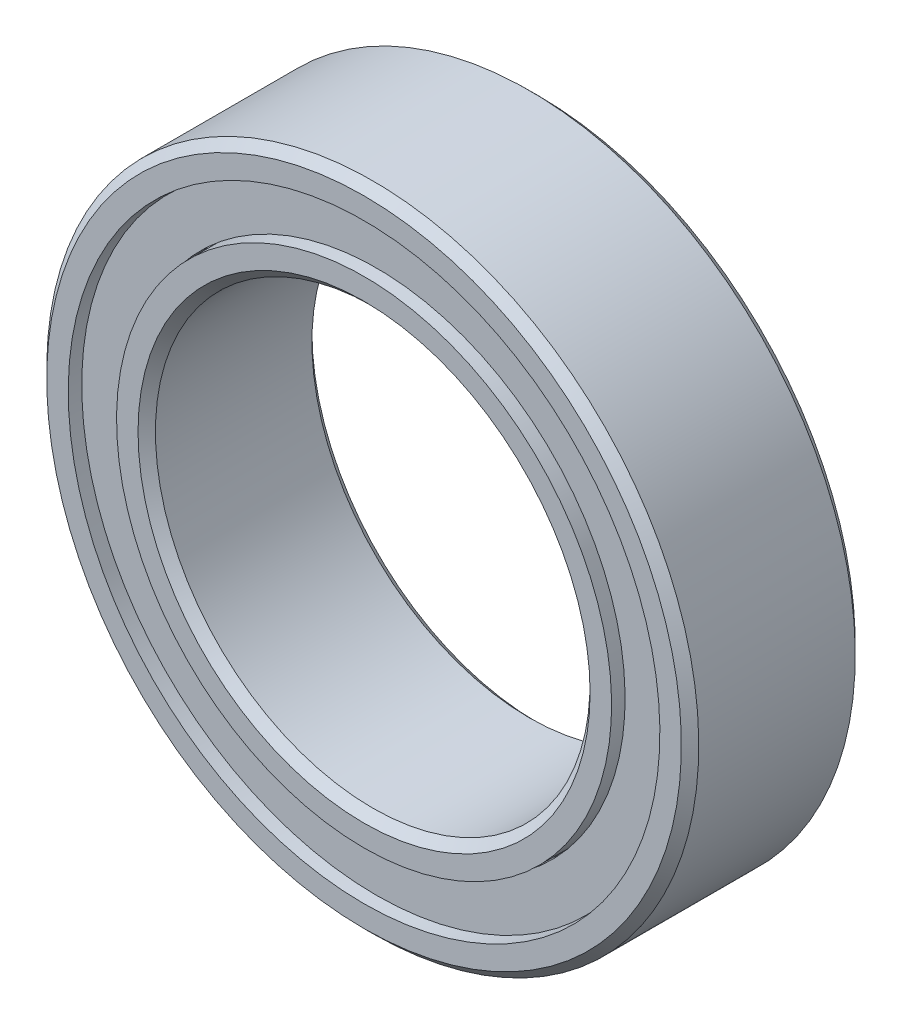
ISO-10303-21;
HEADER;
FILE_DESCRIPTION(('STEP AP214'),'2;1');
FILE_NAME('part.step','',(''),(''),'','','');
FILE_SCHEMA(('AUTOMOTIVE_DESIGN { 1 0 10303 214 1 1 1 1 }'));
ENDSEC;
DATA;
#1=APPLICATION_CONTEXT('core data for automotive mechanical design processes');
#2=APPLICATION_PROTOCOL_DEFINITION('international standard','automotive_design',2000,#1);
#3=PRODUCT_CONTEXT('',#1,'mechanical');
#4=PRODUCT('Part','Part','',(#3));
#5=PRODUCT_RELATED_PRODUCT_CATEGORY('part','',(#4));
#6=PRODUCT_DEFINITION_FORMATION('','',#4);
#7=PRODUCT_DEFINITION_CONTEXT('part definition',#1,'design');
#8=PRODUCT_DEFINITION('design','',#6,#7);
#9=PRODUCT_DEFINITION_SHAPE('','',#8);
#10=(LENGTH_UNIT() NAMED_UNIT(*) SI_UNIT(.MILLI.,.METRE.));
#11=(NAMED_UNIT(*) PLANE_ANGLE_UNIT() SI_UNIT($,.RADIAN.));
#12=(NAMED_UNIT(*) SI_UNIT($,.STERADIAN.) SOLID_ANGLE_UNIT());
#13=UNCERTAINTY_MEASURE_WITH_UNIT(LENGTH_MEASURE(1.E-05),#10,'distance_accuracy_value','');
#14=(GEOMETRIC_REPRESENTATION_CONTEXT(3) GLOBAL_UNCERTAINTY_ASSIGNED_CONTEXT((#13)) GLOBAL_UNIT_ASSIGNED_CONTEXT((#10,
#11,#12)) REPRESENTATION_CONTEXT('',''));
#15=CARTESIAN_POINT('',(0.,0.,0.));
#16=DIRECTION('',(0.,0.,1.));
#17=DIRECTION('',(1.,0.,0.));
#18=AXIS2_PLACEMENT_3D('',#15,#16,#17);
#19=CARTESIAN_POINT('',(3.37900510909742,5.25783458019492,0.));
#20=DIRECTION('',(0.,0.,1.));
#21=DIRECTION('',(0.540640817455587,0.841253532831188,0.));
#22=AXIS2_PLACEMENT_3D('',#19,#20,#21);
#23=SPHERICAL_SURFACE('',#22,1.04822012578407);
#24=CARTESIAN_POINT('',(3.37900510909742,5.25783458019492,1.04822012578406));
#25=VERTEX_POINT('',#24);
#26=VERTEX_LOOP('',#25);
#27=FACE_BOUND('',#26,.T.);
#28=ADVANCED_FACE('F42',(#27),#23,.T.);
#29=CLOSED_SHELL('',(#28));
#30=MANIFOLD_SOLID_BREP('B2',#29);
#31=CARTESIAN_POINT('',(5.68519997096571,2.59634383126185,0.));
#32=DIRECTION('',(0.,0.,1.));
#33=DIRECTION('',(0.909631995354514,0.415415013001897,0.));
#34=AXIS2_PLACEMENT_3D('',#31,#32,#33);
#35=SPHERICAL_SURFACE('',#34,1.04822012578407);
#36=CARTESIAN_POINT('',(5.68519997096571,2.59634383126185,1.04822012578406));
#37=VERTEX_POINT('',#36);
#38=VERTEX_LOOP('',#37);
#39=FACE_BOUND('',#38,.T.);
#40=ADVANCED_FACE('F61',(#39),#35,.T.);
#41=CLOSED_SHELL('',(#40));
#42=MANIFOLD_SOLID_BREP('B6',#41);
#43=CARTESIAN_POINT('',(6.18638401175584,-0.889467739207972,0.));
#44=DIRECTION('',(0.,0.,1.));
#45=DIRECTION('',(0.989821441880934,-0.142314838273276,0.));
#46=AXIS2_PLACEMENT_3D('',#43,#44,#45);
#47=SPHERICAL_SURFACE('',#46,1.04822012578407);
#48=CARTESIAN_POINT('',(6.18638401175584,-0.889467739207972,1.04822012578406));
#49=VERTEX_POINT('',#48);
#50=VERTEX_LOOP('',#49);
#51=FACE_BOUND('',#50,.T.);
#52=ADVANCED_FACE('F80',(#51),#47,.T.);
#53=CLOSED_SHELL('',(#52));
#54=MANIFOLD_SOLID_BREP('B38',#53);
#55=CARTESIAN_POINT('',(4.72343483971415,-4.09287958715799,0.));
#56=DIRECTION('',(0.,0.,1.));
#57=DIRECTION('',(0.755749574354264,-0.654860733945279,0.));
#58=AXIS2_PLACEMENT_3D('',#55,#56,#57);
#59=SPHERICAL_SURFACE('',#58,1.04822012578407);
#60=CARTESIAN_POINT('',(4.72343483971415,-4.09287958715799,1.04822012578406));
#61=VERTEX_POINT('',#60);
#62=VERTEX_LOOP('',#61);
#63=FACE_BOUND('',#62,.T.);
#64=ADVANCED_FACE('F99',(#63),#59,.T.);
#65=CLOSED_SHELL('',(#64));
#66=MANIFOLD_SOLID_BREP('B57',#65);
#67=CARTESIAN_POINT('',(1.76082848025898,-5.99683108509059,0.));
#68=DIRECTION('',(0.,0.,1.));
#69=DIRECTION('',(0.281732556841437,-0.959492973614495,0.));
#70=AXIS2_PLACEMENT_3D('',#67,#68,#69);
#71=SPHERICAL_SURFACE('',#70,1.04822012578407);
#72=CARTESIAN_POINT('',(1.76082848025898,-5.99683108509059,1.04822012578406));
#73=VERTEX_POINT('',#72);
#74=VERTEX_LOOP('',#73);
#75=FACE_BOUND('',#74,.T.);
#76=ADVANCED_FACE('F118',(#75),#71,.T.);
#77=CLOSED_SHELL('',(#76));
#78=MANIFOLD_SOLID_BREP('B76',#77);
#79=CARTESIAN_POINT('',(-1.7608284802589,-5.99683108509062,0.));
#80=DIRECTION('',(0.,0.,1.));
#81=DIRECTION('',(-0.281732556841424,-0.959492973614499,0.));
#82=AXIS2_PLACEMENT_3D('',#79,#80,#81);
#83=SPHERICAL_SURFACE('',#82,1.04822012578407);
#84=CARTESIAN_POINT('',(-1.7608284802589,-5.99683108509062,1.04822012578406));
#85=VERTEX_POINT('',#84);
#86=VERTEX_LOOP('',#85);
#87=FACE_BOUND('',#86,.T.);
#88=ADVANCED_FACE('F137',(#87),#83,.T.);
#89=CLOSED_SHELL('',(#88));
#90=MANIFOLD_SOLID_BREP('B95',#89);
#91=CARTESIAN_POINT('',(-4.72343483971409,-4.09287958715805,0.));
#92=DIRECTION('',(0.,0.,1.));
#93=DIRECTION('',(-0.755749574354255,-0.654860733945289,0.));
#94=AXIS2_PLACEMENT_3D('',#91,#92,#93);
#95=SPHERICAL_SURFACE('',#94,1.04822012578407);
#96=CARTESIAN_POINT('',(-4.72343483971409,-4.09287958715805,1.04822012578406));
#97=VERTEX_POINT('',#96);
#98=VERTEX_LOOP('',#97);
#99=FACE_BOUND('',#98,.T.);
#100=ADVANCED_FACE('F156',(#99),#95,.T.);
#101=CLOSED_SHELL('',(#100));
#102=MANIFOLD_SOLID_BREP('B114',#101);
#103=CARTESIAN_POINT('',(-6.18638401175583,-0.889467739208054,0.));
#104=DIRECTION('',(0.,0.,1.));
#105=DIRECTION('',(-0.989821441880932,-0.142314838273289,0.));
#106=AXIS2_PLACEMENT_3D('',#103,#104,#105);
#107=SPHERICAL_SURFACE('',#106,1.04822012578407);
#108=CARTESIAN_POINT('',(-6.18638401175583,-0.889467739208054,1.04822012578406));
#109=VERTEX_POINT('',#108);
#110=VERTEX_LOOP('',#109);
#111=FACE_BOUND('',#110,.T.);
#112=ADVANCED_FACE('F175',(#111),#107,.T.);
#113=CLOSED_SHELL('',(#112));
#114=MANIFOLD_SOLID_BREP('B133',#113);
#115=CARTESIAN_POINT('',(-5.68519997096575,2.59634383126178,0.));
#116=DIRECTION('',(0.,0.,1.));
#117=DIRECTION('',(-0.90963199535452,0.415415013001884,0.));
#118=AXIS2_PLACEMENT_3D('',#115,#116,#117);
#119=SPHERICAL_SURFACE('',#118,1.04822012578407);
#120=CARTESIAN_POINT('',(-5.68519997096575,2.59634383126178,1.04822012578406));
#121=VERTEX_POINT('',#120);
#122=VERTEX_LOOP('',#121);
#123=FACE_BOUND('',#122,.T.);
#124=ADVANCED_FACE('F194',(#123),#119,.T.);
#125=CLOSED_SHELL('',(#124));
#126=MANIFOLD_SOLID_BREP('B152',#125);
#127=CARTESIAN_POINT('',(-3.37900510909749,5.25783458019488,0.));
#128=DIRECTION('',(0.,0.,1.));
#129=DIRECTION('',(-0.540640817455599,0.841253532831181,0.));
#130=AXIS2_PLACEMENT_3D('',#127,#128,#129);
#131=SPHERICAL_SURFACE('',#130,1.04822012578407);
#132=CARTESIAN_POINT('',(-3.37900510909749,5.25783458019488,1.04822012578406));
#133=VERTEX_POINT('',#132);
#134=VERTEX_LOOP('',#133);
#135=FACE_BOUND('',#134,.T.);
#136=ADVANCED_FACE('F213',(#135),#131,.T.);
#137=CLOSED_SHELL('',(#136));
#138=MANIFOLD_SOLID_BREP('B171',#137);
#139=CARTESIAN_POINT('',(0.,6.25,0.));
#140=DIRECTION('',(0.,0.,1.));
#141=DIRECTION('',(0.,1.,0.));
#142=AXIS2_PLACEMENT_3D('',#139,#140,#141);
#143=SPHERICAL_SURFACE('',#142,1.04822012578407);
#144=CARTESIAN_POINT('',(0.,6.25,1.04822012578406));
#145=VERTEX_POINT('',#144);
#146=VERTEX_LOOP('',#145);
#147=FACE_BOUND('',#146,.T.);
#148=ADVANCED_FACE('F234',(#147),#143,.T.);
#149=CLOSED_SHELL('',(#148));
#150=MANIFOLD_SOLID_BREP('B190',#149);
#151=CARTESIAN_POINT('',(0.,5.69444444444443,2.00000000000003));
#152=DIRECTION('',(0.,0.,-1.));
#153=DIRECTION('',(0.,1.,0.));
#154=AXIS2_PLACEMENT_3D('',#151,#152,#153);
#155=PLANE('',#154);
#156=CARTESIAN_POINT('',(0.,0.,2.00000000000003));
#157=DIRECTION('',(0.,0.,1.));
#158=DIRECTION('',(0.,-1.,0.));
#159=AXIS2_PLACEMENT_3D('',#156,#157,#158);
#160=CIRCLE('',#159,5.19999999999999);
#161=CARTESIAN_POINT('',(0.,-5.19999999999999,2.00000000000003));
#162=VERTEX_POINT('',#161);
#163=EDGE_CURVE('E281',#162,#162,#160,.T.);
#164=ORIENTED_EDGE('',*,*,#163,.F.);
#165=EDGE_LOOP('',(#164));
#166=FACE_BOUND('',#165,.T.);
#167=CARTESIAN_POINT('',(0.,0.,2.00000000000003));
#168=DIRECTION('',(0.,0.,1.));
#169=DIRECTION('',(0.,-1.,0.));
#170=AXIS2_PLACEMENT_3D('',#167,#168,#169);
#171=CIRCLE('',#170,5.69444444444443);
#172=CARTESIAN_POINT('',(0.,-5.69444444444443,2.00000000000003));
#173=VERTEX_POINT('',#172);
#174=EDGE_CURVE('E233',#173,#173,#171,.T.);
#175=ORIENTED_EDGE('',*,*,#174,.T.);
#176=EDGE_LOOP('',(#175));
#177=FACE_BOUND('',#176,.T.);
#178=ADVANCED_FACE('F253',(#166,#177),#155,.F.);
#179=CARTESIAN_POINT('',(0.,0.,2.00000000000002));
#180=DIRECTION('',(0.,0.,1.));
#181=DIRECTION('',(0.,-1.,0.));
#182=AXIS2_PLACEMENT_3D('',#179,#180,#181);
#183=CYLINDRICAL_SURFACE('',#182,5.69444444444443);
#184=ORIENTED_EDGE('',*,*,#174,.F.);
#185=EDGE_LOOP('',(#184));
#186=FACE_BOUND('',#185,.T.);
#187=CARTESIAN_POINT('',(0.,0.,0.888888888888882));
#188=DIRECTION('',(0.,0.,1.));
#189=DIRECTION('',(0.,-1.,0.));
#190=AXIS2_PLACEMENT_3D('',#187,#188,#189);
#191=CIRCLE('',#190,5.69444444444443);
#192=CARTESIAN_POINT('',(0.,-5.69444444444443,0.888888888888882));
#193=VERTEX_POINT('',#192);
#194=EDGE_CURVE('E259',#193,#193,#191,.T.);
#195=ORIENTED_EDGE('',*,*,#194,.T.);
#196=EDGE_LOOP('',(#195));
#197=FACE_BOUND('',#196,.T.);
#198=ADVANCED_FACE('F288',(#186,#197),#183,.T.);
#199=CARTESIAN_POINT('',(0.,0.,0.));
#200=DIRECTION('',(0.,0.,1.));
#201=DIRECTION('',(0.,-1.,0.));
#202=AXIS2_PLACEMENT_3D('',#199,#200,#201);
#203=TOROIDAL_SURFACE('',#202,6.24999999999999,1.04822012578407);
#204=ORIENTED_EDGE('',*,*,#194,.F.);
#205=EDGE_LOOP('',(#204));
#206=FACE_BOUND('',#205,.T.);
#207=CARTESIAN_POINT('',(0.,0.,-0.888888888888884));
#208=DIRECTION('',(0.,0.,1.));
#209=DIRECTION('',(0.,-1.,0.));
#210=AXIS2_PLACEMENT_3D('',#207,#208,#209);
#211=CIRCLE('',#210,5.69444444444443);
#212=CARTESIAN_POINT('',(0.,-5.69444444444443,-0.888888888888885));
#213=VERTEX_POINT('',#212);
#214=EDGE_CURVE('E263',#213,#213,#211,.T.);
#215=ORIENTED_EDGE('',*,*,#214,.T.);
#216=EDGE_LOOP('',(#215));
#217=FACE_BOUND('',#216,.T.);
#218=ADVANCED_FACE('F292',(#206,#217),#203,.F.);
#219=CARTESIAN_POINT('',(0.,0.,2.00000000000002));
#220=DIRECTION('',(0.,0.,1.));
#221=DIRECTION('',(0.,-1.,0.));
#222=AXIS2_PLACEMENT_3D('',#219,#220,#221);
#223=CYLINDRICAL_SURFACE('',#222,5.69444444444443);
#224=ORIENTED_EDGE('',*,*,#214,.F.);
#225=EDGE_LOOP('',(#224));
#226=FACE_BOUND('',#225,.T.);
#227=CARTESIAN_POINT('',(0.,0.,-2.00000000000003));
#228=DIRECTION('',(0.,0.,1.));
#229=DIRECTION('',(0.,-1.,0.));
#230=AXIS2_PLACEMENT_3D('',#227,#228,#229);
#231=CIRCLE('',#230,5.69444444444443);
#232=CARTESIAN_POINT('',(0.,-5.69444444444442,-2.00000000000003));
#233=VERTEX_POINT('',#232);
#234=EDGE_CURVE('E267',#233,#233,#231,.T.);
#235=ORIENTED_EDGE('',*,*,#234,.T.);
#236=EDGE_LOOP('',(#235));
#237=FACE_BOUND('',#236,.T.);
#238=ADVANCED_FACE('F297',(#226,#237),#223,.T.);
#239=CARTESIAN_POINT('',(0.,5.2,-2.00000000000003));
#240=DIRECTION('',(0.,0.,1.));
#241=DIRECTION('',(0.,-1.,0.));
#242=AXIS2_PLACEMENT_3D('',#239,#240,#241);
#243=PLANE('',#242);
#244=ORIENTED_EDGE('',*,*,#234,.F.);
#245=EDGE_LOOP('',(#244));
#246=FACE_BOUND('',#245,.T.);
#247=CARTESIAN_POINT('',(0.,0.,-2.00000000000003));
#248=DIRECTION('',(0.,0.,1.));
#249=DIRECTION('',(0.,-1.,0.));
#250=AXIS2_PLACEMENT_3D('',#247,#248,#249);
#251=CIRCLE('',#250,5.2);
#252=CARTESIAN_POINT('',(0.,-5.2,-2.00000000000004));
#253=VERTEX_POINT('',#252);
#254=EDGE_CURVE('E272',#253,#253,#251,.T.);
#255=ORIENTED_EDGE('',*,*,#254,.T.);
#256=EDGE_LOOP('',(#255));
#257=FACE_BOUND('',#256,.T.);
#258=ADVANCED_FACE('F303',(#246,#257),#243,.F.);
#259=CARTESIAN_POINT('',(0.,0.,-1.80000000000003));
#260=DIRECTION('',(0.,0.,-1.));
#261=DIRECTION('',(0.,1.,0.));
#262=AXIS2_PLACEMENT_3D('',#259,#260,#261);
#263=CONICAL_SURFACE('',#262,4.99999999999999,0.785398163397475);
#264=ORIENTED_EDGE('',*,*,#254,.F.);
#265=EDGE_LOOP('',(#264));
#266=FACE_BOUND('',#265,.T.);
#267=CARTESIAN_POINT('',(0.,0.,-1.80000000000003));
#268=DIRECTION('',(0.,0.,1.));
#269=DIRECTION('',(0.,-1.,0.));
#270=AXIS2_PLACEMENT_3D('',#267,#268,#269);
#271=CIRCLE('',#270,4.99999999999999);
#272=CARTESIAN_POINT('',(0.,-4.99999999999999,-1.80000000000003));
#273=VERTEX_POINT('',#272);
#274=EDGE_CURVE('E275',#273,#273,#271,.T.);
#275=ORIENTED_EDGE('',*,*,#274,.T.);
#276=EDGE_LOOP('',(#275));
#277=FACE_BOUND('',#276,.T.);
#278=ADVANCED_FACE('F307',(#266,#277),#263,.F.);
#279=CARTESIAN_POINT('',(0.,0.,2.00000000000002));
#280=DIRECTION('',(0.,0.,1.));
#281=DIRECTION('',(0.,-1.,0.));
#282=AXIS2_PLACEMENT_3D('',#279,#280,#281);
#283=CYLINDRICAL_SURFACE('',#282,4.99999999999999);
#284=ORIENTED_EDGE('',*,*,#274,.F.);
#285=EDGE_LOOP('',(#284));
#286=FACE_BOUND('',#285,.T.);
#287=CARTESIAN_POINT('',(0.,0.,1.80000000000002));
#288=DIRECTION('',(0.,0.,1.));
#289=DIRECTION('',(0.,-1.,0.));
#290=AXIS2_PLACEMENT_3D('',#287,#288,#289);
#291=CIRCLE('',#290,5.);
#292=CARTESIAN_POINT('',(0.,-5.,1.80000000000001));
#293=VERTEX_POINT('',#292);
#294=EDGE_CURVE('E278',#293,#293,#291,.T.);
#295=ORIENTED_EDGE('',*,*,#294,.T.);
#296=EDGE_LOOP('',(#295));
#297=FACE_BOUND('',#296,.T.);
#298=ADVANCED_FACE('F311',(#286,#297),#283,.F.);
#299=CARTESIAN_POINT('',(0.,0.,2.00000000000003));
#300=DIRECTION('',(0.,0.,1.));
#301=DIRECTION('',(0.,-1.,0.));
#302=AXIS2_PLACEMENT_3D('',#299,#300,#301);
#303=CONICAL_SURFACE('',#302,5.19999999999999,0.785398163397398);
#304=ORIENTED_EDGE('',*,*,#294,.F.);
#305=EDGE_LOOP('',(#304));
#306=FACE_BOUND('',#305,.T.);
#307=ORIENTED_EDGE('',*,*,#163,.T.);
#308=EDGE_LOOP('',(#307));
#309=FACE_BOUND('',#308,.T.);
#310=ADVANCED_FACE('F285',(#306,#309),#303,.F.);
#311=CLOSED_SHELL('',(#178,#198,#218,#238,#258,#278,#298,#310));
#312=MANIFOLD_SOLID_BREP('B209',#311);
#313=CARTESIAN_POINT('',(0.,5.71984444444445,-1.33361006289205));
#314=DIRECTION('',(0.,0.,-1.));
#315=DIRECTION('',(0.,1.,0.));
#316=AXIS2_PLACEMENT_3D('',#313,#314,#315);
#317=PLANE('',#316);
#318=CARTESIAN_POINT('',(0.,0.,-1.33361006289205));
#319=DIRECTION('',(0.,0.,1.));
#320=DIRECTION('',(0.,-1.,0.));
#321=AXIS2_PLACEMENT_3D('',#318,#319,#320);
#322=CIRCLE('',#321,5.71984444444445);
#323=CARTESIAN_POINT('',(0.,-5.71984444444445,-1.33361006289205));
#324=VERTEX_POINT('',#323);
#325=EDGE_CURVE('E381',#324,#324,#322,.T.);
#326=ORIENTED_EDGE('',*,*,#325,.F.);
#327=EDGE_LOOP('',(#326));
#328=FACE_BOUND('',#327,.T.);
#329=CARTESIAN_POINT('',(0.,0.,-1.33361006289205));
#330=DIRECTION('',(0.,0.,1.));
#331=DIRECTION('',(0.,-1.,0.));
#332=AXIS2_PLACEMENT_3D('',#329,#330,#331);
#333=CIRCLE('',#332,6.78015555555556);
#334=CARTESIAN_POINT('',(0.,-6.78015555555556,-1.33361006289205));
#335=VERTEX_POINT('',#334);
#336=EDGE_CURVE('E252',#335,#335,#333,.T.);
#337=ORIENTED_EDGE('',*,*,#336,.T.);
#338=EDGE_LOOP('',(#337));
#339=FACE_BOUND('',#338,.T.);
#340=ADVANCED_FACE('F367',(#328,#339),#317,.F.);
#341=CARTESIAN_POINT('',(0.,0.,2.00000000000002));
#342=DIRECTION('',(0.,0.,1.));
#343=DIRECTION('',(0.,-1.,0.));
#344=AXIS2_PLACEMENT_3D('',#341,#342,#343);
#345=CYLINDRICAL_SURFACE('',#344,6.78015555555556);
#346=ORIENTED_EDGE('',*,*,#336,.F.);
#347=EDGE_LOOP('',(#346));
#348=FACE_BOUND('',#347,.T.);
#349=CARTESIAN_POINT('',(0.,0.,-1.71461006289205));
#350=DIRECTION('',(0.,0.,1.));
#351=DIRECTION('',(0.,-1.,0.));
#352=AXIS2_PLACEMENT_3D('',#349,#350,#351);
#353=CIRCLE('',#352,6.78015555555556);
#354=CARTESIAN_POINT('',(0.,-6.78015555555555,-1.71461006289205));
#355=VERTEX_POINT('',#354);
#356=EDGE_CURVE('E373',#355,#355,#353,.T.);
#357=ORIENTED_EDGE('',*,*,#356,.T.);
#358=EDGE_LOOP('',(#357));
#359=FACE_BOUND('',#358,.T.);
#360=ADVANCED_FACE('F390',(#348,#359),#345,.T.);
#361=CARTESIAN_POINT('',(0.,5.71984444444445,-1.71461006289205));
#362=DIRECTION('',(0.,0.,1.));
#363=DIRECTION('',(0.,-1.,0.));
#364=AXIS2_PLACEMENT_3D('',#361,#362,#363);
#365=PLANE('',#364);
#366=ORIENTED_EDGE('',*,*,#356,.F.);
#367=EDGE_LOOP('',(#366));
#368=FACE_BOUND('',#367,.T.);
#369=CARTESIAN_POINT('',(0.,0.,-1.71461006289205));
#370=DIRECTION('',(0.,0.,1.));
#371=DIRECTION('',(0.,-1.,0.));
#372=AXIS2_PLACEMENT_3D('',#369,#370,#371);
#373=CIRCLE('',#372,5.71984444444445);
#374=CARTESIAN_POINT('',(0.,-5.71984444444445,-1.71461006289205));
#375=VERTEX_POINT('',#374);
#376=EDGE_CURVE('E377',#375,#375,#373,.T.);
#377=ORIENTED_EDGE('',*,*,#376,.T.);
#378=EDGE_LOOP('',(#377));
#379=FACE_BOUND('',#378,.T.);
#380=ADVANCED_FACE('F394',(#368,#379),#365,.F.);
#381=CARTESIAN_POINT('',(0.,0.,2.00000000000002));
#382=DIRECTION('',(0.,0.,1.));
#383=DIRECTION('',(0.,-1.,0.));
#384=AXIS2_PLACEMENT_3D('',#381,#382,#383);
#385=CYLINDRICAL_SURFACE('',#384,5.71984444444445);
#386=ORIENTED_EDGE('',*,*,#376,.F.);
#387=EDGE_LOOP('',(#386));
#388=FACE_BOUND('',#387,.T.);
#389=ORIENTED_EDGE('',*,*,#325,.T.);
#390=EDGE_LOOP('',(#389));
#391=FACE_BOUND('',#390,.T.);
#392=ADVANCED_FACE('F387',(#388,#391),#385,.F.);
#393=CLOSED_SHELL('',(#340,#360,#380,#392));
#394=MANIFOLD_SOLID_BREP('B228',#393);
#395=CARTESIAN_POINT('',(0.,5.71984444444445,1.71461006289204));
#396=DIRECTION('',(0.,0.,-1.));
#397=DIRECTION('',(0.,1.,0.));
#398=AXIS2_PLACEMENT_3D('',#395,#396,#397);
#399=PLANE('',#398);
#400=CARTESIAN_POINT('',(0.,0.,1.71461006289204));
#401=DIRECTION('',(0.,0.,1.));
#402=DIRECTION('',(0.,-1.,0.));
#403=AXIS2_PLACEMENT_3D('',#400,#401,#402);
#404=CIRCLE('',#403,5.71984444444445);
#405=CARTESIAN_POINT('',(0.,-5.71984444444445,1.71461006289204));
#406=VERTEX_POINT('',#405);
#407=EDGE_CURVE('E366',#406,#406,#404,.T.);
#408=ORIENTED_EDGE('',*,*,#407,.F.);
#409=EDGE_LOOP('',(#408));
#410=FACE_BOUND('',#409,.T.);
#411=CARTESIAN_POINT('',(0.,0.,1.71461006289204));
#412=DIRECTION('',(0.,0.,1.));
#413=DIRECTION('',(0.,-1.,0.));
#414=AXIS2_PLACEMENT_3D('',#411,#412,#413);
#415=CIRCLE('',#414,6.78015555555556);
#416=CARTESIAN_POINT('',(0.,-6.78015555555556,1.71461006289204));
#417=VERTEX_POINT('',#416);
#418=EDGE_CURVE('E442',#417,#417,#415,.T.);
#419=ORIENTED_EDGE('',*,*,#418,.T.);
#420=EDGE_LOOP('',(#419));
#421=FACE_BOUND('',#420,.T.);
#422=ADVANCED_FACE('F428',(#410,#421),#399,.F.);
#423=CARTESIAN_POINT('',(0.,0.,2.00000000000002));
#424=DIRECTION('',(0.,0.,1.));
#425=DIRECTION('',(0.,-1.,0.));
#426=AXIS2_PLACEMENT_3D('',#423,#424,#425);
#427=CYLINDRICAL_SURFACE('',#426,5.71984444444445);
#428=CARTESIAN_POINT('',(0.,0.,1.33361006289204));
#429=DIRECTION('',(0.,0.,1.));
#430=DIRECTION('',(0.,-1.,0.));
#431=AXIS2_PLACEMENT_3D('',#428,#429,#430);
#432=CIRCLE('',#431,5.71984444444445);
#433=CARTESIAN_POINT('',(0.,-5.71984444444445,1.33361006289204));
#434=VERTEX_POINT('',#433);
#435=EDGE_CURVE('E434',#434,#434,#432,.T.);
#436=ORIENTED_EDGE('',*,*,#435,.F.);
#437=EDGE_LOOP('',(#436));
#438=FACE_BOUND('',#437,.T.);
#439=ORIENTED_EDGE('',*,*,#407,.T.);
#440=EDGE_LOOP('',(#439));
#441=FACE_BOUND('',#440,.T.);
#442=ADVANCED_FACE('F457',(#438,#441),#427,.F.);
#443=CARTESIAN_POINT('',(0.,5.71984444444445,1.33361006289204));
#444=DIRECTION('',(0.,0.,1.));
#445=DIRECTION('',(0.,-1.,0.));
#446=AXIS2_PLACEMENT_3D('',#443,#444,#445);
#447=PLANE('',#446);
#448=CARTESIAN_POINT('',(0.,0.,1.33361006289204));
#449=DIRECTION('',(0.,0.,1.));
#450=DIRECTION('',(0.,-1.,0.));
#451=AXIS2_PLACEMENT_3D('',#448,#449,#450);
#452=CIRCLE('',#451,6.78015555555556);
#453=CARTESIAN_POINT('',(0.,-6.78015555555556,1.33361006289204));
#454=VERTEX_POINT('',#453);
#455=EDGE_CURVE('E438',#454,#454,#452,.T.);
#456=ORIENTED_EDGE('',*,*,#455,.F.);
#457=EDGE_LOOP('',(#456));
#458=FACE_BOUND('',#457,.T.);
#459=ORIENTED_EDGE('',*,*,#435,.T.);
#460=EDGE_LOOP('',(#459));
#461=FACE_BOUND('',#460,.T.);
#462=ADVANCED_FACE('F452',(#458,#461),#447,.F.);
#463=CARTESIAN_POINT('',(0.,0.,2.00000000000002));
#464=DIRECTION('',(0.,0.,1.));
#465=DIRECTION('',(0.,-1.,0.));
#466=AXIS2_PLACEMENT_3D('',#463,#464,#465);
#467=CYLINDRICAL_SURFACE('',#466,6.78015555555556);
#468=ORIENTED_EDGE('',*,*,#418,.F.);
#469=EDGE_LOOP('',(#468));
#470=FACE_BOUND('',#469,.T.);
#471=ORIENTED_EDGE('',*,*,#455,.T.);
#472=EDGE_LOOP('',(#471));
#473=FACE_BOUND('',#472,.T.);
#474=ADVANCED_FACE('F449',(#470,#473),#467,.T.);
#475=CLOSED_SHELL('',(#422,#442,#462,#474));
#476=MANIFOLD_SOLID_BREP('B247',#475);
#477=CARTESIAN_POINT('',(0.,0.,1.80000000000002));
#478=DIRECTION('',(0.,0.,-1.));
#479=DIRECTION('',(0.,1.,0.));
#480=AXIS2_PLACEMENT_3D('',#477,#478,#479);
#481=CONICAL_SURFACE('',#480,7.49999999999999,0.785398163397463);
#482=CARTESIAN_POINT('',(0.,0.,2.00000000000002));
#483=DIRECTION('',(0.,0.,1.));
#484=DIRECTION('',(0.,-1.,0.));
#485=AXIS2_PLACEMENT_3D('',#482,#483,#484);
#486=CIRCLE('',#485,7.29999999999999);
#487=CARTESIAN_POINT('',(0.,-7.29999999999999,2.00000000000002));
#488=VERTEX_POINT('',#487);
#489=EDGE_CURVE('E510',#488,#488,#486,.T.);
#490=ORIENTED_EDGE('',*,*,#489,.F.);
#491=EDGE_LOOP('',(#490));
#492=FACE_BOUND('',#491,.T.);
#493=CARTESIAN_POINT('',(0.,0.,1.80000000000002));
#494=DIRECTION('',(0.,0.,1.));
#495=DIRECTION('',(0.,-1.,0.));
#496=AXIS2_PLACEMENT_3D('',#493,#494,#495);
#497=CIRCLE('',#496,7.49999999999999);
#498=CARTESIAN_POINT('',(0.,-7.49999999999999,1.80000000000002));
#499=VERTEX_POINT('',#498);
#500=EDGE_CURVE('E427',#499,#499,#497,.T.);
#501=ORIENTED_EDGE('',*,*,#500,.T.);
#502=EDGE_LOOP('',(#501));
#503=FACE_BOUND('',#502,.T.);
#504=ADVANCED_FACE('F482',(#492,#503),#481,.T.);
#505=CARTESIAN_POINT('',(0.,0.,2.00000000000002));
#506=DIRECTION('',(0.,0.,1.));
#507=DIRECTION('',(0.,-1.,0.));
#508=AXIS2_PLACEMENT_3D('',#505,#506,#507);
#509=CYLINDRICAL_SURFACE('',#508,7.49999999999999);
#510=ORIENTED_EDGE('',*,*,#500,.F.);
#511=EDGE_LOOP('',(#510));
#512=FACE_BOUND('',#511,.T.);
#513=CARTESIAN_POINT('',(0.,0.,-1.80000000000003));
#514=DIRECTION('',(0.,0.,1.));
#515=DIRECTION('',(0.,-1.,0.));
#516=AXIS2_PLACEMENT_3D('',#513,#514,#515);
#517=CIRCLE('',#516,7.49999999999999);
#518=CARTESIAN_POINT('',(0.,-7.49999999999999,-1.80000000000003));
#519=VERTEX_POINT('',#518);
#520=EDGE_CURVE('E488',#519,#519,#517,.T.);
#521=ORIENTED_EDGE('',*,*,#520,.T.);
#522=EDGE_LOOP('',(#521));
#523=FACE_BOUND('',#522,.T.);
#524=ADVANCED_FACE('F517',(#512,#523),#509,.T.);
#525=CARTESIAN_POINT('',(0.,0.,-2.00000000000003));
#526=DIRECTION('',(0.,0.,1.));
#527=DIRECTION('',(0.,-1.,0.));
#528=AXIS2_PLACEMENT_3D('',#525,#526,#527);
#529=CONICAL_SURFACE('',#528,7.29999999999999,0.785398163397463);
#530=ORIENTED_EDGE('',*,*,#520,.F.);
#531=EDGE_LOOP('',(#530));
#532=FACE_BOUND('',#531,.T.);
#533=CARTESIAN_POINT('',(0.,0.,-2.00000000000003));
#534=DIRECTION('',(0.,0.,1.));
#535=DIRECTION('',(0.,-1.,0.));
#536=AXIS2_PLACEMENT_3D('',#533,#534,#535);
#537=CIRCLE('',#536,7.29999999999999);
#538=CARTESIAN_POINT('',(0.,-7.29999999999999,-2.00000000000003));
#539=VERTEX_POINT('',#538);
#540=EDGE_CURVE('E492',#539,#539,#537,.T.);
#541=ORIENTED_EDGE('',*,*,#540,.T.);
#542=EDGE_LOOP('',(#541));
#543=FACE_BOUND('',#542,.T.);
#544=ADVANCED_FACE('F521',(#532,#543),#529,.T.);
#545=CARTESIAN_POINT('',(0.,7.29999999999999,-2.00000000000003));
#546=DIRECTION('',(0.,0.,1.));
#547=DIRECTION('',(0.,-1.,0.));
#548=AXIS2_PLACEMENT_3D('',#545,#546,#547);
#549=PLANE('',#548);
#550=ORIENTED_EDGE('',*,*,#540,.F.);
#551=EDGE_LOOP('',(#550));
#552=FACE_BOUND('',#551,.T.);
#553=CARTESIAN_POINT('',(0.,0.,-2.00000000000003));
#554=DIRECTION('',(0.,0.,1.));
#555=DIRECTION('',(0.,-1.,0.));
#556=AXIS2_PLACEMENT_3D('',#553,#554,#555);
#557=CIRCLE('',#556,6.80555555555555);
#558=CARTESIAN_POINT('',(0.,-6.80555555555555,-2.00000000000003));
#559=VERTEX_POINT('',#558);
#560=EDGE_CURVE('E496',#559,#559,#557,.T.);
#561=ORIENTED_EDGE('',*,*,#560,.T.);
#562=EDGE_LOOP('',(#561));
#563=FACE_BOUND('',#562,.T.);
#564=ADVANCED_FACE('F526',(#552,#563),#549,.F.);
#565=CARTESIAN_POINT('',(0.,0.,2.00000000000002));
#566=DIRECTION('',(0.,0.,1.));
#567=DIRECTION('',(0.,-1.,0.));
#568=AXIS2_PLACEMENT_3D('',#565,#566,#567);
#569=CYLINDRICAL_SURFACE('',#568,6.80555555555555);
#570=ORIENTED_EDGE('',*,*,#560,.F.);
#571=EDGE_LOOP('',(#570));
#572=FACE_BOUND('',#571,.T.);
#573=CARTESIAN_POINT('',(0.,0.,-0.888888888888897));
#574=DIRECTION('',(0.,0.,1.));
#575=DIRECTION('',(0.,-1.,0.));
#576=AXIS2_PLACEMENT_3D('',#573,#574,#575);
#577=CIRCLE('',#576,6.80555555555555);
#578=CARTESIAN_POINT('',(0.,-6.80555555555555,-0.888888888888897));
#579=VERTEX_POINT('',#578);
#580=EDGE_CURVE('E501',#579,#579,#577,.T.);
#581=ORIENTED_EDGE('',*,*,#580,.T.);
#582=EDGE_LOOP('',(#581));
#583=FACE_BOUND('',#582,.T.);
#584=ADVANCED_FACE('F532',(#572,#583),#569,.F.);
#585=CARTESIAN_POINT('',(0.,0.,0.));
#586=DIRECTION('',(0.,0.,1.));
#587=DIRECTION('',(0.,-1.,0.));
#588=AXIS2_PLACEMENT_3D('',#585,#586,#587);
#589=TOROIDAL_SURFACE('',#588,6.25,1.04822012578407);
#590=ORIENTED_EDGE('',*,*,#580,.F.);
#591=EDGE_LOOP('',(#590));
#592=FACE_BOUND('',#591,.T.);
#593=CARTESIAN_POINT('',(0.,0.,0.888888888888883));
#594=DIRECTION('',(0.,0.,1.));
#595=DIRECTION('',(0.,-1.,0.));
#596=AXIS2_PLACEMENT_3D('',#593,#594,#595);
#597=CIRCLE('',#596,6.80555555555555);
#598=CARTESIAN_POINT('',(0.,-6.80555555555555,0.888888888888882));
#599=VERTEX_POINT('',#598);
#600=EDGE_CURVE('E504',#599,#599,#597,.T.);
#601=ORIENTED_EDGE('',*,*,#600,.T.);
#602=EDGE_LOOP('',(#601));
#603=FACE_BOUND('',#602,.T.);
#604=ADVANCED_FACE('F536',(#592,#603),#589,.F.);
#605=CARTESIAN_POINT('',(0.,0.,2.00000000000002));
#606=DIRECTION('',(0.,0.,1.));
#607=DIRECTION('',(0.,-1.,0.));
#608=AXIS2_PLACEMENT_3D('',#605,#606,#607);
#609=CYLINDRICAL_SURFACE('',#608,6.80555555555555);
#610=ORIENTED_EDGE('',*,*,#600,.F.);
#611=EDGE_LOOP('',(#610));
#612=FACE_BOUND('',#611,.T.);
#613=CARTESIAN_POINT('',(0.,0.,2.00000000000001));
#614=DIRECTION('',(0.,0.,1.));
#615=DIRECTION('',(0.,-1.,0.));
#616=AXIS2_PLACEMENT_3D('',#613,#614,#615);
#617=CIRCLE('',#616,6.80555555555555);
#618=CARTESIAN_POINT('',(0.,-6.80555555555555,2.00000000000001));
#619=VERTEX_POINT('',#618);
#620=EDGE_CURVE('E507',#619,#619,#617,.T.);
#621=ORIENTED_EDGE('',*,*,#620,.T.);
#622=EDGE_LOOP('',(#621));
#623=FACE_BOUND('',#622,.T.);
#624=ADVANCED_FACE('F540',(#612,#623),#609,.F.);
#625=CARTESIAN_POINT('',(0.,7.29999999999999,2.00000000000002));
#626=DIRECTION('',(0.,0.,-1.));
#627=DIRECTION('',(0.,1.,0.));
#628=AXIS2_PLACEMENT_3D('',#625,#626,#627);
#629=PLANE('',#628);
#630=ORIENTED_EDGE('',*,*,#620,.F.);
#631=EDGE_LOOP('',(#630));
#632=FACE_BOUND('',#631,.T.);
#633=ORIENTED_EDGE('',*,*,#489,.T.);
#634=EDGE_LOOP('',(#633));
#635=FACE_BOUND('',#634,.T.);
#636=ADVANCED_FACE('F514',(#632,#635),#629,.F.);
#637=CLOSED_SHELL('',(#504,#524,#544,#564,#584,#604,#624,#636));
#638=MANIFOLD_SOLID_BREP('B361',#637);
#639=ADVANCED_BREP_SHAPE_REPRESENTATION('',(#18,#30,#42,#54,#66,#78,#90,#102,#114,#126,#138,
#150,#312,#394,#476,#638),#14);
#640=SHAPE_DEFINITION_REPRESENTATION(#9,#639);
ENDSEC;
END-ISO-10303-21;
